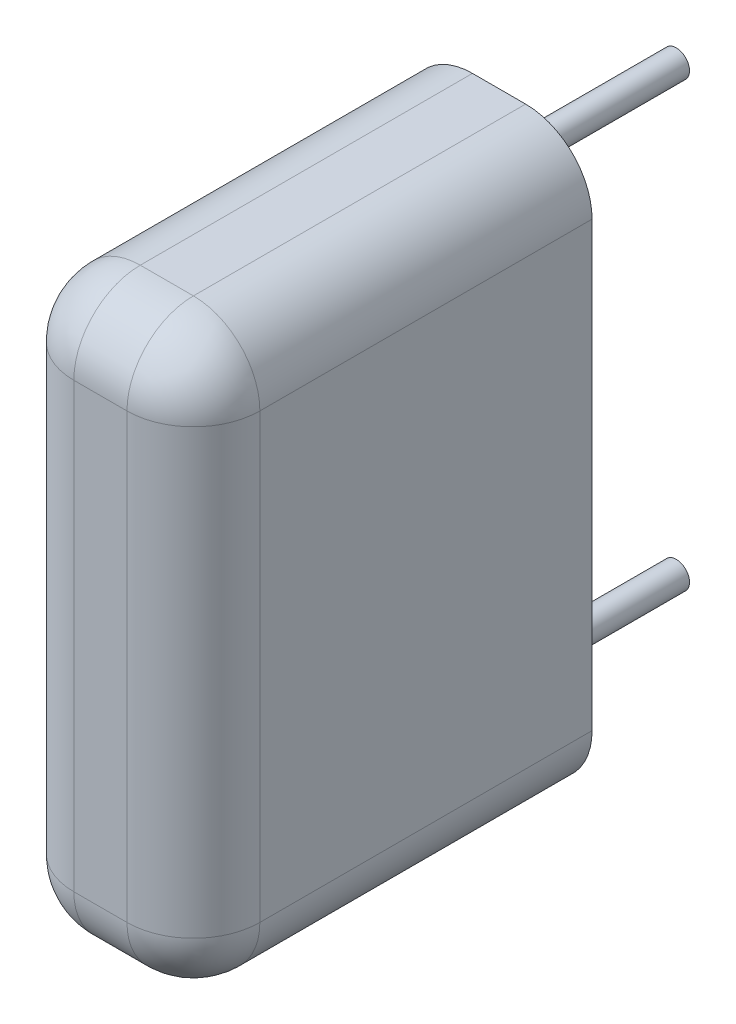
ISO-10303-21;
HEADER;
FILE_DESCRIPTION(('STEP AP214'),'2;1');
FILE_NAME('part.step','',(''),(''),'','','');
FILE_SCHEMA(('AUTOMOTIVE_DESIGN { 1 0 10303 214 1 1 1 1 }'));
ENDSEC;
DATA;
#1=APPLICATION_CONTEXT('core data for automotive mechanical design processes');
#2=APPLICATION_PROTOCOL_DEFINITION('international standard','automotive_design',2000,#1);
#3=PRODUCT_CONTEXT('',#1,'mechanical');
#4=PRODUCT('Part','Part','',(#3));
#5=PRODUCT_RELATED_PRODUCT_CATEGORY('part','',(#4));
#6=PRODUCT_DEFINITION_FORMATION('','',#4);
#7=PRODUCT_DEFINITION_CONTEXT('part definition',#1,'design');
#8=PRODUCT_DEFINITION('design','',#6,#7);
#9=PRODUCT_DEFINITION_SHAPE('','',#8);
#10=(LENGTH_UNIT() NAMED_UNIT(*) SI_UNIT(.MILLI.,.METRE.));
#11=(NAMED_UNIT(*) PLANE_ANGLE_UNIT() SI_UNIT($,.RADIAN.));
#12=(NAMED_UNIT(*) SI_UNIT($,.STERADIAN.) SOLID_ANGLE_UNIT());
#13=UNCERTAINTY_MEASURE_WITH_UNIT(LENGTH_MEASURE(1.E-05),#10,'distance_accuracy_value','');
#14=(GEOMETRIC_REPRESENTATION_CONTEXT(3) GLOBAL_UNCERTAINTY_ASSIGNED_CONTEXT((#13)) GLOBAL_UNIT_ASSIGNED_CONTEXT((#10,
#11,#12)) REPRESENTATION_CONTEXT('',''));
#15=CARTESIAN_POINT('',(0.,0.,0.));
#16=DIRECTION('',(0.,0.,1.));
#17=DIRECTION('',(1.,0.,0.));
#18=AXIS2_PLACEMENT_3D('',#15,#16,#17);
#19=CARTESIAN_POINT('',(0.,0.,0.));
#20=DIRECTION('',(0.,0.,1.));
#21=DIRECTION('',(1.,0.,0.));
#22=AXIS2_PLACEMENT_3D('',#19,#20,#21);
#23=PLANE('',#22);
#24=CARTESIAN_POINT('',(0.,0.,0.));
#25=DIRECTION('',(0.,0.,1.));
#26=DIRECTION('',(1.,0.,0.));
#27=AXIS2_PLACEMENT_3D('',#24,#25,#26);
#28=CIRCLE('',#27,0.3);
#29=CARTESIAN_POINT('',(0.3,0.,0.));
#30=VERTEX_POINT('',#29);
#31=EDGE_CURVE('E221',#30,#30,#28,.F.);
#32=ORIENTED_EDGE('',*,*,#31,.F.);
#33=EDGE_LOOP('',(#32));
#34=FACE_BOUND('',#33,.T.);
#35=DIRECTION('',(0.,1.,0.));
#36=VECTOR('',#35,1.);
#37=CARTESIAN_POINT('',(2.1,1.5,0.));
#38=LINE('',#37,#36);
#39=CARTESIAN_POINT('',(2.1,-10.,0.));
#40=VERTEX_POINT('',#39);
#41=CARTESIAN_POINT('',(2.1,0.,0.));
#42=VERTEX_POINT('',#41);
#43=EDGE_CURVE('E215',#40,#42,#38,.T.);
#44=ORIENTED_EDGE('',*,*,#43,.F.);
#45=CARTESIAN_POINT('',(0.599999999999999,-10.,0.));
#46=DIRECTION('',(0.,0.,1.));
#47=DIRECTION('',(1.,0.,0.));
#48=AXIS2_PLACEMENT_3D('',#45,#46,#47);
#49=CIRCLE('',#48,1.5);
#50=CARTESIAN_POINT('',(0.599999999999999,-11.5,0.));
#51=VERTEX_POINT('',#50);
#52=EDGE_CURVE('E11',#40,#51,#49,.F.);
#53=ORIENTED_EDGE('',*,*,#52,.T.);
#54=DIRECTION('',(1.,0.,0.));
#55=VECTOR('',#54,1.);
#56=CARTESIAN_POINT('',(-2.1,-11.5,0.));
#57=LINE('',#56,#55);
#58=CARTESIAN_POINT('',(-0.600000000000001,-11.5,0.));
#59=VERTEX_POINT('',#58);
#60=EDGE_CURVE('E212',#59,#51,#57,.T.);
#61=ORIENTED_EDGE('',*,*,#60,.F.);
#62=CARTESIAN_POINT('',(-0.600000000000002,-10.,0.));
#63=DIRECTION('',(0.,0.,1.));
#64=DIRECTION('',(1.,0.,0.));
#65=AXIS2_PLACEMENT_3D('',#62,#63,#64);
#66=CIRCLE('',#65,1.5);
#67=CARTESIAN_POINT('',(-2.1,-10.,0.));
#68=VERTEX_POINT('',#67);
#69=EDGE_CURVE('E44',#59,#68,#66,.F.);
#70=ORIENTED_EDGE('',*,*,#69,.T.);
#71=DIRECTION('',(0.,-1.,0.));
#72=VECTOR('',#71,1.);
#73=CARTESIAN_POINT('',(-2.1,1.5,0.));
#74=LINE('',#73,#72);
#75=CARTESIAN_POINT('',(-2.1,0.,0.));
#76=VERTEX_POINT('',#75);
#77=EDGE_CURVE('E208',#76,#68,#74,.T.);
#78=ORIENTED_EDGE('',*,*,#77,.F.);
#79=CARTESIAN_POINT('',(-0.600000000000001,0.,0.));
#80=DIRECTION('',(0.,0.,1.));
#81=DIRECTION('',(1.,0.,0.));
#82=AXIS2_PLACEMENT_3D('',#79,#80,#81);
#83=CIRCLE('',#82,1.5);
#84=CARTESIAN_POINT('',(-0.600000000000001,1.5,0.));
#85=VERTEX_POINT('',#84);
#86=EDGE_CURVE('E175',#76,#85,#83,.F.);
#87=ORIENTED_EDGE('',*,*,#86,.T.);
#88=DIRECTION('',(-1.,0.,0.));
#89=VECTOR('',#88,1.);
#90=CARTESIAN_POINT('',(-2.1,1.5,0.));
#91=LINE('',#90,#89);
#92=CARTESIAN_POINT('',(0.6,1.5,0.));
#93=VERTEX_POINT('',#92);
#94=EDGE_CURVE('E218',#93,#85,#91,.T.);
#95=ORIENTED_EDGE('',*,*,#94,.F.);
#96=CARTESIAN_POINT('',(0.6,0.,0.));
#97=DIRECTION('',(0.,0.,1.));
#98=DIRECTION('',(1.,0.,0.));
#99=AXIS2_PLACEMENT_3D('',#96,#97,#98);
#100=CIRCLE('',#99,1.5);
#101=EDGE_CURVE('E173',#93,#42,#100,.F.);
#102=ORIENTED_EDGE('',*,*,#101,.T.);
#103=EDGE_LOOP('',(#44,#53,#61,#70,#78,#87,#95,#102));
#104=FACE_BOUND('',#103,.T.);
#105=CARTESIAN_POINT('',(0.,-10.,0.));
#106=DIRECTION('',(0.,0.,1.));
#107=DIRECTION('',(1.,0.,0.));
#108=AXIS2_PLACEMENT_3D('',#105,#106,#107);
#109=CIRCLE('',#108,0.3);
#110=CARTESIAN_POINT('',(0.3,-10.,0.));
#111=VERTEX_POINT('',#110);
#112=EDGE_CURVE('E142',#111,#111,#109,.F.);
#113=ORIENTED_EDGE('',*,*,#112,.F.);
#114=EDGE_LOOP('',(#113));
#115=FACE_BOUND('',#114,.T.);
#116=ADVANCED_FACE('F35',(#34,#104,#115),#23,.F.);
#117=CARTESIAN_POINT('',(-2.1,1.5,9.));
#118=DIRECTION('',(1.,0.,0.));
#119=DIRECTION('',(0.,1.,0.));
#120=AXIS2_PLACEMENT_3D('',#117,#118,#119);
#121=PLANE('',#120);
#122=ORIENTED_EDGE('',*,*,#77,.T.);
#123=DIRECTION('',(0.,0.,-1.));
#124=VECTOR('',#123,1.);
#125=CARTESIAN_POINT('',(-2.1,-10.,9.));
#126=LINE('',#125,#124);
#127=CARTESIAN_POINT('',(-2.1,-10.,7.5));
#128=VERTEX_POINT('',#127);
#129=EDGE_CURVE('E52',#68,#128,#126,.F.);
#130=ORIENTED_EDGE('',*,*,#129,.T.);
#131=DIRECTION('',(0.,-1.,0.));
#132=VECTOR('',#131,1.);
#133=CARTESIAN_POINT('',(-2.1,1.5,7.5));
#134=LINE('',#133,#132);
#135=CARTESIAN_POINT('',(-2.1,0.,7.5));
#136=VERTEX_POINT('',#135);
#137=EDGE_CURVE('E57',#128,#136,#134,.F.);
#138=ORIENTED_EDGE('',*,*,#137,.T.);
#139=DIRECTION('',(0.,0.,-1.));
#140=VECTOR('',#139,1.);
#141=CARTESIAN_POINT('',(-2.1,0.,9.));
#142=LINE('',#141,#140);
#143=EDGE_CURVE('E169',#136,#76,#142,.T.);
#144=ORIENTED_EDGE('',*,*,#143,.T.);
#145=EDGE_LOOP('',(#122,#130,#138,#144));
#146=FACE_BOUND('',#145,.T.);
#147=ADVANCED_FACE('F250',(#146),#121,.F.);
#148=CARTESIAN_POINT('',(-2.1,-11.5,9.));
#149=DIRECTION('',(0.,1.,0.));
#150=DIRECTION('',(-1.,0.,0.));
#151=AXIS2_PLACEMENT_3D('',#148,#149,#150);
#152=PLANE('',#151);
#153=ORIENTED_EDGE('',*,*,#60,.T.);
#154=DIRECTION('',(0.,0.,-1.));
#155=VECTOR('',#154,1.);
#156=CARTESIAN_POINT('',(0.599999999999999,-11.5,9.));
#157=LINE('',#156,#155);
#158=CARTESIAN_POINT('',(0.599999999999999,-11.5,7.5));
#159=VERTEX_POINT('',#158);
#160=EDGE_CURVE('E167',#51,#159,#157,.F.);
#161=ORIENTED_EDGE('',*,*,#160,.T.);
#162=DIRECTION('',(1.,0.,0.));
#163=VECTOR('',#162,1.);
#164=CARTESIAN_POINT('',(-2.1,-11.5,7.5));
#165=LINE('',#164,#163);
#166=CARTESIAN_POINT('',(-0.600000000000001,-11.5,7.5));
#167=VERTEX_POINT('',#166);
#168=EDGE_CURVE('E165',#159,#167,#165,.F.);
#169=ORIENTED_EDGE('',*,*,#168,.T.);
#170=DIRECTION('',(0.,0.,-1.));
#171=VECTOR('',#170,1.);
#172=CARTESIAN_POINT('',(-0.600000000000001,-11.5,9.));
#173=LINE('',#172,#171);
#174=EDGE_CURVE('E163',#167,#59,#173,.T.);
#175=ORIENTED_EDGE('',*,*,#174,.T.);
#176=EDGE_LOOP('',(#153,#161,#169,#175));
#177=FACE_BOUND('',#176,.T.);
#178=ADVANCED_FACE('F275',(#177),#152,.F.);
#179=CARTESIAN_POINT('',(2.1,1.5,9.));
#180=DIRECTION('',(-1.,0.,0.));
#181=DIRECTION('',(0.,-1.,0.));
#182=AXIS2_PLACEMENT_3D('',#179,#180,#181);
#183=PLANE('',#182);
#184=DIRECTION('',(0.,1.,0.));
#185=VECTOR('',#184,1.);
#186=CARTESIAN_POINT('',(2.1,-11.5,7.5));
#187=LINE('',#186,#185);
#188=CARTESIAN_POINT('',(2.1,0.,7.5));
#189=VERTEX_POINT('',#188);
#190=CARTESIAN_POINT('',(2.1,-10.,7.5));
#191=VERTEX_POINT('',#190);
#192=EDGE_CURVE('E159',#189,#191,#187,.F.);
#193=ORIENTED_EDGE('',*,*,#192,.T.);
#194=DIRECTION('',(0.,0.,-1.));
#195=VECTOR('',#194,1.);
#196=CARTESIAN_POINT('',(2.1,-10.,9.));
#197=LINE('',#196,#195);
#198=EDGE_CURVE('E161',#191,#40,#197,.T.);
#199=ORIENTED_EDGE('',*,*,#198,.T.);
#200=ORIENTED_EDGE('',*,*,#43,.T.);
#201=DIRECTION('',(0.,0.,-1.));
#202=VECTOR('',#201,1.);
#203=CARTESIAN_POINT('',(2.1,0.,9.));
#204=LINE('',#203,#202);
#205=EDGE_CURVE('E157',#42,#189,#204,.F.);
#206=ORIENTED_EDGE('',*,*,#205,.T.);
#207=EDGE_LOOP('',(#193,#199,#200,#206));
#208=FACE_BOUND('',#207,.T.);
#209=ADVANCED_FACE('F283',(#208),#183,.F.);
#210=CARTESIAN_POINT('',(-2.1,1.5,9.));
#211=DIRECTION('',(0.,-1.,0.));
#212=DIRECTION('',(1.,0.,0.));
#213=AXIS2_PLACEMENT_3D('',#210,#211,#212);
#214=PLANE('',#213);
#215=ORIENTED_EDGE('',*,*,#94,.T.);
#216=DIRECTION('',(0.,0.,-1.));
#217=VECTOR('',#216,1.);
#218=CARTESIAN_POINT('',(-0.600000000000001,1.5,9.));
#219=LINE('',#218,#217);
#220=CARTESIAN_POINT('',(-0.600000000000001,1.5,7.5));
#221=VERTEX_POINT('',#220);
#222=EDGE_CURVE('E155',#85,#221,#219,.F.);
#223=ORIENTED_EDGE('',*,*,#222,.T.);
#224=DIRECTION('',(-1.,0.,0.));
#225=VECTOR('',#224,1.);
#226=CARTESIAN_POINT('',(2.1,1.5,7.5));
#227=LINE('',#226,#225);
#228=CARTESIAN_POINT('',(0.6,1.5,7.5));
#229=VERTEX_POINT('',#228);
#230=EDGE_CURVE('E120',#221,#229,#227,.F.);
#231=ORIENTED_EDGE('',*,*,#230,.T.);
#232=DIRECTION('',(0.,0.,-1.));
#233=VECTOR('',#232,1.);
#234=CARTESIAN_POINT('',(0.6,1.5,9.));
#235=LINE('',#234,#233);
#236=EDGE_CURVE('E148',#229,#93,#235,.T.);
#237=ORIENTED_EDGE('',*,*,#236,.T.);
#238=EDGE_LOOP('',(#215,#223,#231,#237));
#239=FACE_BOUND('',#238,.T.);
#240=ADVANCED_FACE('F244',(#239),#214,.F.);
#241=CARTESIAN_POINT('',(0.,0.,9.));
#242=DIRECTION('',(0.,0.,1.));
#243=DIRECTION('',(1.,0.,0.));
#244=AXIS2_PLACEMENT_3D('',#241,#242,#243);
#245=PLANE('',#244);
#246=DIRECTION('',(0.,1.,0.));
#247=VECTOR('',#246,1.);
#248=CARTESIAN_POINT('',(0.6,1.5,9.));
#249=LINE('',#248,#247);
#250=CARTESIAN_POINT('',(0.599999999999999,-10.,9.));
#251=VERTEX_POINT('',#250);
#252=CARTESIAN_POINT('',(0.6,0.,9.));
#253=VERTEX_POINT('',#252);
#254=EDGE_CURVE('E146',#251,#253,#249,.T.);
#255=ORIENTED_EDGE('',*,*,#254,.T.);
#256=DIRECTION('',(-1.,0.,0.));
#257=VECTOR('',#256,1.);
#258=CARTESIAN_POINT('',(-2.1,0.,9.));
#259=LINE('',#258,#257);
#260=CARTESIAN_POINT('',(-0.600000000000001,0.,9.));
#261=VERTEX_POINT('',#260);
#262=EDGE_CURVE('E118',#253,#261,#259,.T.);
#263=ORIENTED_EDGE('',*,*,#262,.T.);
#264=DIRECTION('',(0.,-1.,0.));
#265=VECTOR('',#264,1.);
#266=CARTESIAN_POINT('',(-0.600000000000002,-11.5,9.));
#267=LINE('',#266,#265);
#268=CARTESIAN_POINT('',(-0.600000000000002,-10.,9.));
#269=VERTEX_POINT('',#268);
#270=EDGE_CURVE('E135',#261,#269,#267,.T.);
#271=ORIENTED_EDGE('',*,*,#270,.T.);
#272=DIRECTION('',(1.,0.,0.));
#273=VECTOR('',#272,1.);
#274=CARTESIAN_POINT('',(2.1,-10.,9.));
#275=LINE('',#274,#273);
#276=EDGE_CURVE('E141',#269,#251,#275,.T.);
#277=ORIENTED_EDGE('',*,*,#276,.T.);
#278=EDGE_LOOP('',(#255,#263,#271,#277));
#279=FACE_BOUND('',#278,.T.);
#280=ADVANCED_FACE('F144',(#279),#245,.T.);
#281=CARTESIAN_POINT('',(0.,0.,-4.));
#282=DIRECTION('',(0.,0.,1.));
#283=DIRECTION('',(1.,0.,0.));
#284=AXIS2_PLACEMENT_3D('',#281,#282,#283);
#285=CYLINDRICAL_SURFACE('',#284,0.3);
#286=CARTESIAN_POINT('',(0.,0.,-4.));
#287=DIRECTION('',(0.,0.,-1.));
#288=DIRECTION('',(-1.,0.,0.));
#289=AXIS2_PLACEMENT_3D('',#286,#287,#288);
#290=CIRCLE('',#289,0.3);
#291=CARTESIAN_POINT('',(-0.3,0.,-4.));
#292=VERTEX_POINT('',#291);
#293=EDGE_CURVE('E203',#292,#292,#290,.T.);
#294=ORIENTED_EDGE('',*,*,#293,.F.);
#295=EDGE_LOOP('',(#294));
#296=FACE_BOUND('',#295,.T.);
#297=ORIENTED_EDGE('',*,*,#31,.T.);
#298=EDGE_LOOP('',(#297));
#299=FACE_BOUND('',#298,.T.);
#300=ADVANCED_FACE('F397',(#296,#299),#285,.T.);
#301=CARTESIAN_POINT('',(0.,0.,-4.));
#302=DIRECTION('',(0.,0.,-1.));
#303=DIRECTION('',(-1.,0.,0.));
#304=AXIS2_PLACEMENT_3D('',#301,#302,#303);
#305=PLANE('',#304);
#306=ORIENTED_EDGE('',*,*,#293,.T.);
#307=EDGE_LOOP('',(#306));
#308=FACE_BOUND('',#307,.T.);
#309=ADVANCED_FACE('F388',(#308),#305,.T.);
#310=CARTESIAN_POINT('',(0.,-10.,-4.));
#311=DIRECTION('',(0.,0.,1.));
#312=DIRECTION('',(1.,0.,0.));
#313=AXIS2_PLACEMENT_3D('',#310,#311,#312);
#314=CYLINDRICAL_SURFACE('',#313,0.3);
#315=CARTESIAN_POINT('',(0.,-10.,-4.));
#316=DIRECTION('',(0.,0.,-1.));
#317=DIRECTION('',(-1.,0.,0.));
#318=AXIS2_PLACEMENT_3D('',#315,#316,#317);
#319=CIRCLE('',#318,0.3);
#320=CARTESIAN_POINT('',(-0.3,-10.,-4.));
#321=VERTEX_POINT('',#320);
#322=EDGE_CURVE('E200',#321,#321,#319,.T.);
#323=ORIENTED_EDGE('',*,*,#322,.F.);
#324=EDGE_LOOP('',(#323));
#325=FACE_BOUND('',#324,.T.);
#326=ORIENTED_EDGE('',*,*,#112,.T.);
#327=EDGE_LOOP('',(#326));
#328=FACE_BOUND('',#327,.T.);
#329=ADVANCED_FACE('F380',(#325,#328),#314,.T.);
#330=CARTESIAN_POINT('',(0.,-10.,-4.));
#331=DIRECTION('',(0.,0.,-1.));
#332=DIRECTION('',(-1.,0.,0.));
#333=AXIS2_PLACEMENT_3D('',#330,#331,#332);
#334=PLANE('',#333);
#335=ORIENTED_EDGE('',*,*,#322,.T.);
#336=EDGE_LOOP('',(#335));
#337=FACE_BOUND('',#336,.T.);
#338=ADVANCED_FACE('F371',(#337),#334,.T.);
#339=CARTESIAN_POINT('',(0.599999999999999,-10.,9.));
#340=DIRECTION('',(0.,0.,-1.));
#341=DIRECTION('',(-1.,0.,0.));
#342=AXIS2_PLACEMENT_3D('',#339,#340,#341);
#343=CYLINDRICAL_SURFACE('',#342,1.5);
#344=ORIENTED_EDGE('',*,*,#52,.F.);
#345=ORIENTED_EDGE('',*,*,#198,.F.);
#346=CARTESIAN_POINT('',(0.599999999999999,-10.,7.5));
#347=DIRECTION('',(0.,0.,1.));
#348=DIRECTION('',(1.,0.,0.));
#349=AXIS2_PLACEMENT_3D('',#346,#347,#348);
#350=CIRCLE('',#349,1.5);
#351=EDGE_CURVE('E39',#159,#191,#350,.T.);
#352=ORIENTED_EDGE('',*,*,#351,.F.);
#353=ORIENTED_EDGE('',*,*,#160,.F.);
#354=EDGE_LOOP('',(#344,#345,#352,#353));
#355=FACE_BOUND('',#354,.T.);
#356=ADVANCED_FACE('F37',(#355),#343,.T.);
#357=CARTESIAN_POINT('',(0.,-10.,7.5));
#358=DIRECTION('',(-1.,0.,0.));
#359=DIRECTION('',(0.,-1.,0.));
#360=AXIS2_PLACEMENT_3D('',#357,#358,#359);
#361=CYLINDRICAL_SURFACE('',#360,1.5);
#362=CARTESIAN_POINT('',(-0.600000000000002,-10.,7.5));
#363=DIRECTION('',(-1.,0.,0.));
#364=DIRECTION('',(0.,-1.,0.));
#365=AXIS2_PLACEMENT_3D('',#362,#363,#364);
#366=CIRCLE('',#365,1.5);
#367=EDGE_CURVE('E192',#167,#269,#366,.T.);
#368=ORIENTED_EDGE('',*,*,#367,.F.);
#369=ORIENTED_EDGE('',*,*,#168,.F.);
#370=CARTESIAN_POINT('',(0.599999999999999,-10.,7.5));
#371=DIRECTION('',(1.,0.,0.));
#372=DIRECTION('',(0.,1.,0.));
#373=AXIS2_PLACEMENT_3D('',#370,#371,#372);
#374=CIRCLE('',#373,1.5);
#375=EDGE_CURVE('E194',#251,#159,#374,.T.);
#376=ORIENTED_EDGE('',*,*,#375,.F.);
#377=ORIENTED_EDGE('',*,*,#276,.F.);
#378=EDGE_LOOP('',(#368,#369,#376,#377));
#379=FACE_BOUND('',#378,.T.);
#380=ADVANCED_FACE('F228',(#379),#361,.T.);
#381=CARTESIAN_POINT('',(-0.600000000000002,-10.,9.));
#382=DIRECTION('',(0.,0.,-1.));
#383=DIRECTION('',(-1.,0.,0.));
#384=AXIS2_PLACEMENT_3D('',#381,#382,#383);
#385=CYLINDRICAL_SURFACE('',#384,1.5);
#386=ORIENTED_EDGE('',*,*,#69,.F.);
#387=ORIENTED_EDGE('',*,*,#174,.F.);
#388=CARTESIAN_POINT('',(-0.600000000000002,-10.,7.5));
#389=DIRECTION('',(0.,0.,1.));
#390=DIRECTION('',(1.,0.,0.));
#391=AXIS2_PLACEMENT_3D('',#388,#389,#390);
#392=CIRCLE('',#391,1.5);
#393=EDGE_CURVE('E189',#128,#167,#392,.T.);
#394=ORIENTED_EDGE('',*,*,#393,.F.);
#395=ORIENTED_EDGE('',*,*,#129,.F.);
#396=EDGE_LOOP('',(#386,#387,#394,#395));
#397=FACE_BOUND('',#396,.T.);
#398=ADVANCED_FACE('F258',(#397),#385,.T.);
#399=CARTESIAN_POINT('',(0.599999999999999,-10.,7.5));
#400=DIRECTION('',(0.,0.,1.));
#401=DIRECTION('',(1.,0.,0.));
#402=AXIS2_PLACEMENT_3D('',#399,#400,#401);
#403=SPHERICAL_SURFACE('',#402,1.5);
#404=ORIENTED_EDGE('',*,*,#375,.T.);
#405=ORIENTED_EDGE('',*,*,#351,.T.);
#406=CARTESIAN_POINT('',(0.599999999999999,-10.,7.5));
#407=DIRECTION('',(0.,-1.,0.));
#408=DIRECTION('',(0.,0.,-1.));
#409=AXIS2_PLACEMENT_3D('',#406,#407,#408);
#410=CIRCLE('',#409,1.5);
#411=EDGE_CURVE('E186',#251,#191,#410,.F.);
#412=ORIENTED_EDGE('',*,*,#411,.F.);
#413=EDGE_LOOP('',(#404,#405,#412));
#414=FACE_BOUND('',#413,.T.);
#415=ADVANCED_FACE('F229',(#414),#403,.T.);
#416=CARTESIAN_POINT('',(-0.600000000000002,-10.,7.5));
#417=DIRECTION('',(0.,0.,1.));
#418=DIRECTION('',(1.,0.,0.));
#419=AXIS2_PLACEMENT_3D('',#416,#417,#418);
#420=SPHERICAL_SURFACE('',#419,1.5);
#421=ORIENTED_EDGE('',*,*,#393,.T.);
#422=ORIENTED_EDGE('',*,*,#367,.T.);
#423=CARTESIAN_POINT('',(-0.600000000000002,-10.,7.5));
#424=DIRECTION('',(0.,-1.,0.));
#425=DIRECTION('',(0.,0.,-1.));
#426=AXIS2_PLACEMENT_3D('',#423,#424,#425);
#427=CIRCLE('',#426,1.5);
#428=EDGE_CURVE('E138',#128,#269,#427,.F.);
#429=ORIENTED_EDGE('',*,*,#428,.F.);
#430=EDGE_LOOP('',(#421,#422,#429));
#431=FACE_BOUND('',#430,.T.);
#432=ADVANCED_FACE('F260',(#431),#420,.T.);
#433=CARTESIAN_POINT('',(0.6,0.,9.));
#434=DIRECTION('',(0.,0.,-1.));
#435=DIRECTION('',(-1.,0.,0.));
#436=AXIS2_PLACEMENT_3D('',#433,#434,#435);
#437=CYLINDRICAL_SURFACE('',#436,1.5);
#438=ORIENTED_EDGE('',*,*,#101,.F.);
#439=ORIENTED_EDGE('',*,*,#236,.F.);
#440=CARTESIAN_POINT('',(0.6,0.,7.5));
#441=DIRECTION('',(0.,0.,1.));
#442=DIRECTION('',(1.,0.,0.));
#443=AXIS2_PLACEMENT_3D('',#440,#441,#442);
#444=CIRCLE('',#443,1.5);
#445=EDGE_CURVE('E182',#189,#229,#444,.T.);
#446=ORIENTED_EDGE('',*,*,#445,.F.);
#447=ORIENTED_EDGE('',*,*,#205,.F.);
#448=EDGE_LOOP('',(#438,#439,#446,#447));
#449=FACE_BOUND('',#448,.T.);
#450=ADVANCED_FACE('F241',(#449),#437,.T.);
#451=CARTESIAN_POINT('',(0.6,0.,7.5));
#452=DIRECTION('',(0.,-1.,0.));
#453=DIRECTION('',(1.,0.,0.));
#454=AXIS2_PLACEMENT_3D('',#451,#452,#453);
#455=CYLINDRICAL_SURFACE('',#454,1.5);
#456=ORIENTED_EDGE('',*,*,#411,.T.);
#457=ORIENTED_EDGE('',*,*,#192,.F.);
#458=CARTESIAN_POINT('',(0.6,0.,7.5));
#459=DIRECTION('',(0.,1.,0.));
#460=DIRECTION('',(-1.,0.,0.));
#461=AXIS2_PLACEMENT_3D('',#458,#459,#460);
#462=CIRCLE('',#461,1.5);
#463=EDGE_CURVE('E132',#253,#189,#462,.T.);
#464=ORIENTED_EDGE('',*,*,#463,.F.);
#465=ORIENTED_EDGE('',*,*,#254,.F.);
#466=EDGE_LOOP('',(#456,#457,#464,#465));
#467=FACE_BOUND('',#466,.T.);
#468=ADVANCED_FACE('F232',(#467),#455,.T.);
#469=CARTESIAN_POINT('',(-0.600000000000001,0.,7.5));
#470=DIRECTION('',(0.,1.,0.));
#471=DIRECTION('',(-1.,0.,0.));
#472=AXIS2_PLACEMENT_3D('',#469,#470,#471);
#473=CYLINDRICAL_SURFACE('',#472,1.5);
#474=ORIENTED_EDGE('',*,*,#428,.T.);
#475=ORIENTED_EDGE('',*,*,#270,.F.);
#476=CARTESIAN_POINT('',(-0.6,0.,7.5));
#477=DIRECTION('',(0.,1.,0.));
#478=DIRECTION('',(-1.,0.,0.));
#479=AXIS2_PLACEMENT_3D('',#476,#477,#478);
#480=CIRCLE('',#479,1.5);
#481=EDGE_CURVE('E126',#136,#261,#480,.T.);
#482=ORIENTED_EDGE('',*,*,#481,.F.);
#483=ORIENTED_EDGE('',*,*,#137,.F.);
#484=EDGE_LOOP('',(#474,#475,#482,#483));
#485=FACE_BOUND('',#484,.T.);
#486=ADVANCED_FACE('F136',(#485),#473,.T.);
#487=CARTESIAN_POINT('',(-0.600000000000001,0.,9.));
#488=DIRECTION('',(0.,0.,-1.));
#489=DIRECTION('',(-1.,0.,0.));
#490=AXIS2_PLACEMENT_3D('',#487,#488,#489);
#491=CYLINDRICAL_SURFACE('',#490,1.5);
#492=ORIENTED_EDGE('',*,*,#86,.F.);
#493=ORIENTED_EDGE('',*,*,#143,.F.);
#494=CARTESIAN_POINT('',(-0.600000000000001,0.,7.5));
#495=DIRECTION('',(0.,0.,1.));
#496=DIRECTION('',(1.,0.,0.));
#497=AXIS2_PLACEMENT_3D('',#494,#495,#496);
#498=CIRCLE('',#497,1.5);
#499=EDGE_CURVE('E130',#221,#136,#498,.T.);
#500=ORIENTED_EDGE('',*,*,#499,.F.);
#501=ORIENTED_EDGE('',*,*,#222,.F.);
#502=EDGE_LOOP('',(#492,#493,#500,#501));
#503=FACE_BOUND('',#502,.T.);
#504=ADVANCED_FACE('F248',(#503),#491,.T.);
#505=CARTESIAN_POINT('',(0.6,0.,7.5));
#506=DIRECTION('',(0.,0.,1.));
#507=DIRECTION('',(1.,0.,0.));
#508=AXIS2_PLACEMENT_3D('',#505,#506,#507);
#509=SPHERICAL_SURFACE('',#508,1.5);
#510=ORIENTED_EDGE('',*,*,#463,.T.);
#511=ORIENTED_EDGE('',*,*,#445,.T.);
#512=CARTESIAN_POINT('',(0.6,0.,7.5));
#513=DIRECTION('',(1.,0.,0.));
#514=DIRECTION('',(0.,0.,-1.));
#515=AXIS2_PLACEMENT_3D('',#512,#513,#514);
#516=CIRCLE('',#515,1.5);
#517=EDGE_CURVE('E123',#253,#229,#516,.F.);
#518=ORIENTED_EDGE('',*,*,#517,.F.);
#519=EDGE_LOOP('',(#510,#511,#518));
#520=FACE_BOUND('',#519,.T.);
#521=ADVANCED_FACE('F236',(#520),#509,.T.);
#522=CARTESIAN_POINT('',(-0.600000000000001,0.,7.5));
#523=DIRECTION('',(0.,0.,1.));
#524=DIRECTION('',(1.,0.,0.));
#525=AXIS2_PLACEMENT_3D('',#522,#523,#524);
#526=SPHERICAL_SURFACE('',#525,1.5);
#527=ORIENTED_EDGE('',*,*,#499,.T.);
#528=ORIENTED_EDGE('',*,*,#481,.T.);
#529=CARTESIAN_POINT('',(-0.600000000000001,0.,7.5));
#530=DIRECTION('',(-1.,0.,0.));
#531=DIRECTION('',(0.,-1.,0.));
#532=AXIS2_PLACEMENT_3D('',#529,#530,#531);
#533=CIRCLE('',#532,1.5);
#534=EDGE_CURVE('E114',#221,#261,#533,.F.);
#535=ORIENTED_EDGE('',*,*,#534,.F.);
#536=EDGE_LOOP('',(#527,#528,#535));
#537=FACE_BOUND('',#536,.T.);
#538=ADVANCED_FACE('F128',(#537),#526,.T.);
#539=CARTESIAN_POINT('',(0.,0.,7.5));
#540=DIRECTION('',(1.,0.,0.));
#541=DIRECTION('',(0.,1.,0.));
#542=AXIS2_PLACEMENT_3D('',#539,#540,#541);
#543=CYLINDRICAL_SURFACE('',#542,1.5);
#544=ORIENTED_EDGE('',*,*,#517,.T.);
#545=ORIENTED_EDGE('',*,*,#230,.F.);
#546=ORIENTED_EDGE('',*,*,#534,.T.);
#547=ORIENTED_EDGE('',*,*,#262,.F.);
#548=EDGE_LOOP('',(#544,#545,#546,#547));
#549=FACE_BOUND('',#548,.T.);
#550=ADVANCED_FACE('F116',(#549),#543,.T.);
#551=CLOSED_SHELL('',(#116,#147,#178,#209,#240,#280,#300,#309,#329,#338,#356,#380,#398,#415,
#432,#450,#468,#486,#504,#521,#538,#550));
#552=MANIFOLD_SOLID_BREP('B2',#551);
#553=ADVANCED_BREP_SHAPE_REPRESENTATION('',(#18,#552),#14);
#554=SHAPE_DEFINITION_REPRESENTATION(#9,#553);
ENDSEC;
END-ISO-10303-21;
